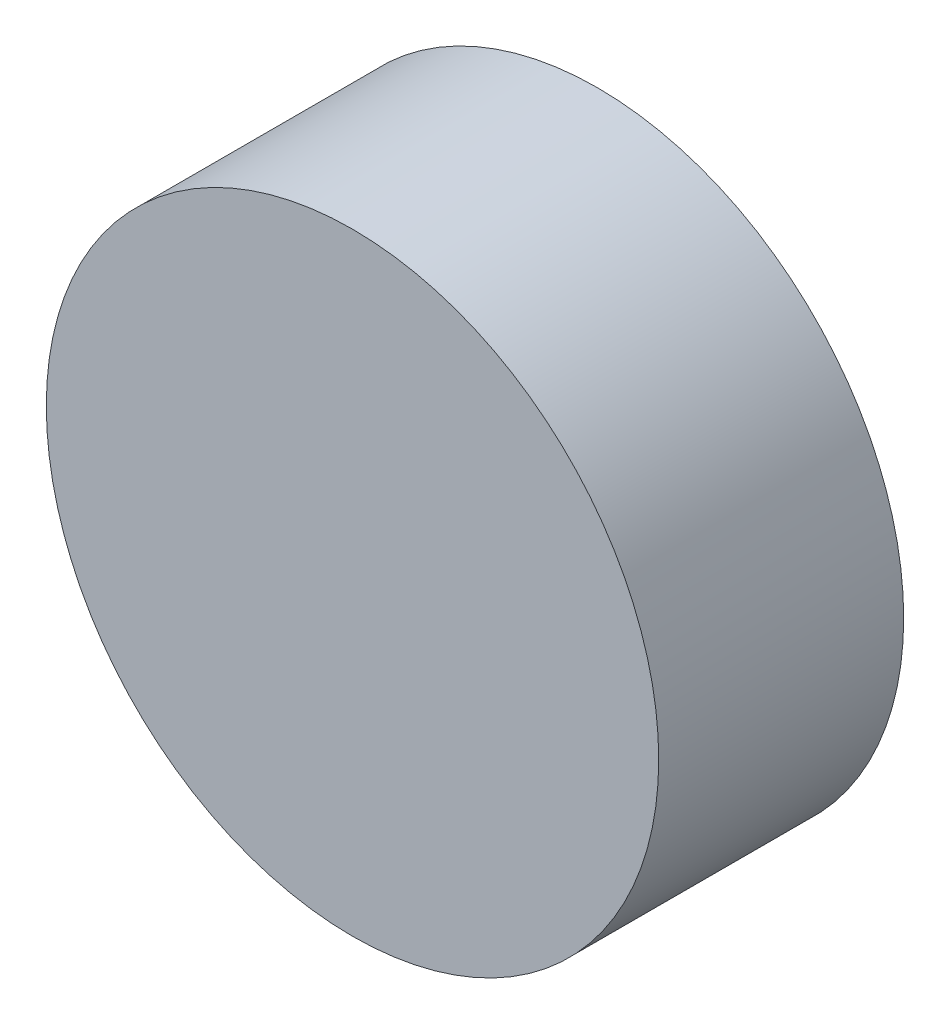
ISO-10303-21;
HEADER;
FILE_DESCRIPTION(('STEP AP214'),'2;1');
FILE_NAME('part.step','',(''),(''),'','','');
FILE_SCHEMA(('AUTOMOTIVE_DESIGN { 1 0 10303 214 1 1 1 1 }'));
ENDSEC;
DATA;
#1=APPLICATION_CONTEXT('core data for automotive mechanical design processes');
#2=APPLICATION_PROTOCOL_DEFINITION('international standard','automotive_design',2000,#1);
#3=PRODUCT_CONTEXT('',#1,'mechanical');
#4=PRODUCT('Part','Part','',(#3));
#5=PRODUCT_RELATED_PRODUCT_CATEGORY('part','',(#4));
#6=PRODUCT_DEFINITION_FORMATION('','',#4);
#7=PRODUCT_DEFINITION_CONTEXT('part definition',#1,'design');
#8=PRODUCT_DEFINITION('design','',#6,#7);
#9=PRODUCT_DEFINITION_SHAPE('','',#8);
#10=(LENGTH_UNIT() NAMED_UNIT(*) SI_UNIT(.MILLI.,.METRE.));
#11=(NAMED_UNIT(*) PLANE_ANGLE_UNIT() SI_UNIT($,.RADIAN.));
#12=(NAMED_UNIT(*) SI_UNIT($,.STERADIAN.) SOLID_ANGLE_UNIT());
#13=UNCERTAINTY_MEASURE_WITH_UNIT(LENGTH_MEASURE(1.E-05),#10,'distance_accuracy_value','');
#14=(GEOMETRIC_REPRESENTATION_CONTEXT(3) GLOBAL_UNCERTAINTY_ASSIGNED_CONTEXT((#13)) GLOBAL_UNIT_ASSIGNED_CONTEXT((#10,
#11,#12)) REPRESENTATION_CONTEXT('',''));
#15=CARTESIAN_POINT('',(0.,0.,0.));
#16=DIRECTION('',(0.,0.,1.));
#17=DIRECTION('',(1.,0.,0.));
#18=AXIS2_PLACEMENT_3D('',#15,#16,#17);
#19=CARTESIAN_POINT('',(0.,0.,2.));
#20=DIRECTION('',(0.,0.,-1.));
#21=DIRECTION('',(-1.,0.,0.));
#22=AXIS2_PLACEMENT_3D('',#19,#20,#21);
#23=CYLINDRICAL_SURFACE('',#22,2.5);
#24=CARTESIAN_POINT('',(0.,0.,2.));
#25=DIRECTION('',(0.,0.,1.));
#26=DIRECTION('',(1.,0.,0.));
#27=AXIS2_PLACEMENT_3D('',#24,#25,#26);
#28=CIRCLE('',#27,2.5);
#29=CARTESIAN_POINT('',(2.5,0.,2.));
#30=VERTEX_POINT('',#29);
#31=EDGE_CURVE('E10',#30,#30,#28,.T.);
#32=ORIENTED_EDGE('',*,*,#31,.F.);
#33=EDGE_LOOP('',(#32));
#34=FACE_BOUND('',#33,.T.);
#35=CARTESIAN_POINT('',(0.,0.,0.));
#36=DIRECTION('',(0.,0.,1.));
#37=DIRECTION('',(1.,0.,0.));
#38=AXIS2_PLACEMENT_3D('',#35,#36,#37);
#39=CIRCLE('',#38,2.5);
#40=CARTESIAN_POINT('',(2.5,0.,0.));
#41=VERTEX_POINT('',#40);
#42=EDGE_CURVE('E40',#41,#41,#39,.T.);
#43=ORIENTED_EDGE('',*,*,#42,.T.);
#44=EDGE_LOOP('',(#43));
#45=FACE_BOUND('',#44,.T.);
#46=ADVANCED_FACE('F37',(#34,#45),#23,.T.);
#47=CARTESIAN_POINT('',(0.,0.,2.));
#48=DIRECTION('',(0.,0.,1.));
#49=DIRECTION('',(1.,0.,0.));
#50=AXIS2_PLACEMENT_3D('',#47,#48,#49);
#51=PLANE('',#50);
#52=ORIENTED_EDGE('',*,*,#31,.T.);
#53=EDGE_LOOP('',(#52));
#54=FACE_BOUND('',#53,.T.);
#55=ADVANCED_FACE('F54',(#54),#51,.T.);
#56=CARTESIAN_POINT('',(0.,0.,0.));
#57=DIRECTION('',(0.,0.,1.));
#58=DIRECTION('',(1.,0.,0.));
#59=AXIS2_PLACEMENT_3D('',#56,#57,#58);
#60=PLANE('',#59);
#61=ORIENTED_EDGE('',*,*,#42,.F.);
#62=EDGE_LOOP('',(#61));
#63=FACE_BOUND('',#62,.T.);
#64=ADVANCED_FACE('F52',(#63),#60,.F.);
#65=CLOSED_SHELL('',(#46,#55,#64));
#66=MANIFOLD_SOLID_BREP('B2',#65);
#67=ADVANCED_BREP_SHAPE_REPRESENTATION('',(#18,#66),#14);
#68=SHAPE_DEFINITION_REPRESENTATION(#9,#67);
ENDSEC;
END-ISO-10303-21;
